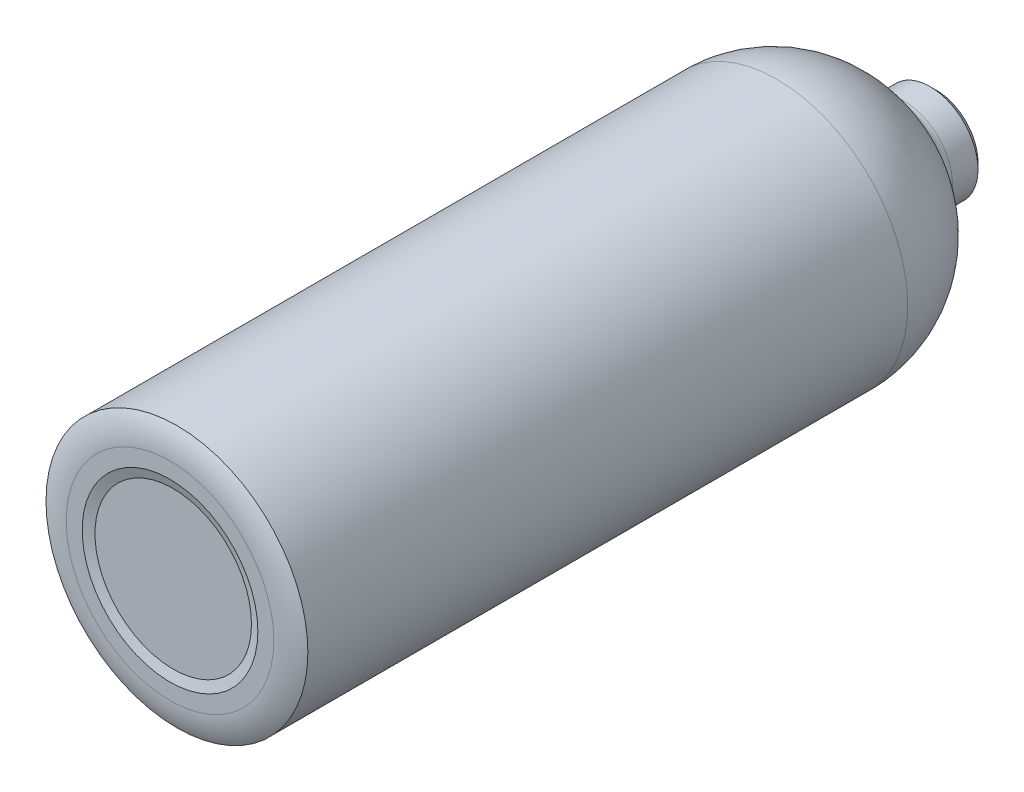
ISO-10303-21;
HEADER;
FILE_DESCRIPTION(('STEP AP214'),'2;1');
FILE_NAME('part.step','',(''),(''),'','','');
FILE_SCHEMA(('AUTOMOTIVE_DESIGN { 1 0 10303 214 1 1 1 1 }'));
ENDSEC;
DATA;
#1=APPLICATION_CONTEXT('core data for automotive mechanical design processes');
#2=APPLICATION_PROTOCOL_DEFINITION('international standard','automotive_design',2000,#1);
#3=PRODUCT_CONTEXT('',#1,'mechanical');
#4=PRODUCT('Part','Part','',(#3));
#5=PRODUCT_RELATED_PRODUCT_CATEGORY('part','',(#4));
#6=PRODUCT_DEFINITION_FORMATION('','',#4);
#7=PRODUCT_DEFINITION_CONTEXT('part definition',#1,'design');
#8=PRODUCT_DEFINITION('design','',#6,#7);
#9=PRODUCT_DEFINITION_SHAPE('','',#8);
#10=(LENGTH_UNIT() NAMED_UNIT(*) SI_UNIT(.MILLI.,.METRE.));
#11=(NAMED_UNIT(*) PLANE_ANGLE_UNIT() SI_UNIT($,.RADIAN.));
#12=(NAMED_UNIT(*) SI_UNIT($,.STERADIAN.) SOLID_ANGLE_UNIT());
#13=UNCERTAINTY_MEASURE_WITH_UNIT(LENGTH_MEASURE(1.E-05),#10,'distance_accuracy_value','');
#14=(GEOMETRIC_REPRESENTATION_CONTEXT(3) GLOBAL_UNCERTAINTY_ASSIGNED_CONTEXT((#13)) GLOBAL_UNIT_ASSIGNED_CONTEXT((#10,
#11,#12)) REPRESENTATION_CONTEXT('',''));
#15=CARTESIAN_POINT('',(0.,0.,0.));
#16=DIRECTION('',(0.,0.,1.));
#17=DIRECTION('',(1.,0.,0.));
#18=AXIS2_PLACEMENT_3D('',#15,#16,#17);
#19=CARTESIAN_POINT('',(0.,0.,52.2686182812824));
#20=DIRECTION('',(0.,0.,-1.));
#21=DIRECTION('',(-1.,0.,0.));
#22=AXIS2_PLACEMENT_3D('',#19,#20,#21);
#23=PLANE('',#22);
#24=CARTESIAN_POINT('',(0.,0.,52.2686182812824));
#25=DIRECTION('',(0.,0.,1.));
#26=DIRECTION('',(1.,0.,0.));
#27=AXIS2_PLACEMENT_3D('',#24,#25,#26);
#28=CIRCLE('',#27,24.5);
#29=CARTESIAN_POINT('',(24.5,0.,52.2686182812824));
#30=VERTEX_POINT('',#29);
#31=EDGE_CURVE('E10',#30,#30,#28,.T.);
#32=ORIENTED_EDGE('',*,*,#31,.T.);
#33=EDGE_LOOP('',(#32));
#34=FACE_BOUND('',#33,.T.);
#35=ADVANCED_FACE('F34',(#34),#23,.F.);
#36=CARTESIAN_POINT('',(0.,0.,53.2686182812824));
#37=DIRECTION('',(0.,0.,1.));
#38=DIRECTION('',(1.,0.,0.));
#39=AXIS2_PLACEMENT_3D('',#36,#37,#38);
#40=CONICAL_SURFACE('',#39,27.5,1.24904577239826);
#41=ORIENTED_EDGE('',*,*,#31,.F.);
#42=EDGE_LOOP('',(#41));
#43=FACE_BOUND('',#42,.T.);
#44=CARTESIAN_POINT('',(0.,0.,53.2686182812824));
#45=DIRECTION('',(0.,0.,1.));
#46=DIRECTION('',(1.,0.,0.));
#47=AXIS2_PLACEMENT_3D('',#44,#45,#46);
#48=CIRCLE('',#47,27.5);
#49=CARTESIAN_POINT('',(27.5,0.,53.2686182812824));
#50=VERTEX_POINT('',#49);
#51=EDGE_CURVE('E40',#50,#50,#48,.T.);
#52=ORIENTED_EDGE('',*,*,#51,.T.);
#53=EDGE_LOOP('',(#52));
#54=FACE_BOUND('',#53,.T.);
#55=ADVANCED_FACE('F96',(#43,#54),#40,.F.);
#56=CARTESIAN_POINT('',(-27.5,0.,53.2686182812824));
#57=DIRECTION('',(0.,0.,-1.));
#58=DIRECTION('',(-1.,0.,0.));
#59=AXIS2_PLACEMENT_3D('',#56,#57,#58);
#60=PLANE('',#59);
#61=ORIENTED_EDGE('',*,*,#51,.F.);
#62=EDGE_LOOP('',(#61));
#63=FACE_BOUND('',#62,.T.);
#64=CARTESIAN_POINT('',(0.,0.,53.2686182812824));
#65=DIRECTION('',(0.,0.,1.));
#66=DIRECTION('',(1.,0.,0.));
#67=AXIS2_PLACEMENT_3D('',#64,#65,#66);
#68=CIRCLE('',#67,32.5);
#69=CARTESIAN_POINT('',(32.5,0.,53.2686182812825));
#70=VERTEX_POINT('',#69);
#71=EDGE_CURVE('E44',#70,#70,#68,.T.);
#72=ORIENTED_EDGE('',*,*,#71,.T.);
#73=EDGE_LOOP('',(#72));
#74=FACE_BOUND('',#73,.T.);
#75=ADVANCED_FACE('F100',(#63,#74),#60,.F.);
#76=CARTESIAN_POINT('',(0.,0.,35.4814493175759));
#77=DIRECTION('',(0.,0.,1.));
#78=DIRECTION('',(1.,0.,0.));
#79=AXIS2_PLACEMENT_3D('',#76,#77,#78);
#80=TOROIDAL_SURFACE('',#79,32.5,17.7871689637066);
#81=ORIENTED_EDGE('',*,*,#71,.F.);
#82=EDGE_LOOP('',(#81));
#83=FACE_BOUND('',#82,.T.);
#84=CARTESIAN_POINT('',(0.,0.,51.106217467646));
#85=DIRECTION('',(0.,0.,1.));
#86=DIRECTION('',(1.,0.,0.));
#87=AXIS2_PLACEMENT_3D('',#84,#85,#86);
#88=CIRCLE('',#87,41.);
#89=CARTESIAN_POINT('',(41.,0.,51.106217467646));
#90=VERTEX_POINT('',#89);
#91=EDGE_CURVE('E48',#90,#90,#88,.T.);
#92=ORIENTED_EDGE('',*,*,#91,.T.);
#93=EDGE_LOOP('',(#92));
#94=FACE_BOUND('',#93,.T.);
#95=ADVANCED_FACE('F105',(#83,#94),#80,.T.);
#96=CARTESIAN_POINT('',(0.,0.,52.2686182812824));
#97=DIRECTION('',(0.,0.,1.));
#98=DIRECTION('',(1.,0.,0.));
#99=AXIS2_PLACEMENT_3D('',#96,#97,#98);
#100=CYLINDRICAL_SURFACE('',#99,41.0000000000001);
#101=ORIENTED_EDGE('',*,*,#91,.F.);
#102=EDGE_LOOP('',(#101));
#103=FACE_BOUND('',#102,.T.);
#104=CARTESIAN_POINT('',(1.19100314647857E-13,0.,-136.731381718718));
#105=DIRECTION('',(0.,0.,1.));
#106=DIRECTION('',(1.,0.,0.));
#107=AXIS2_PLACEMENT_3D('',#104,#105,#106);
#108=CIRCLE('',#107,41.0000000000001);
#109=CARTESIAN_POINT('',(41.0000000000002,0.,-136.731381718718));
#110=VERTEX_POINT('',#109);
#111=EDGE_CURVE('E53',#110,#110,#108,.T.);
#112=ORIENTED_EDGE('',*,*,#111,.T.);
#113=EDGE_LOOP('',(#112));
#114=FACE_BOUND('',#113,.T.);
#115=ADVANCED_FACE('F111',(#103,#114),#100,.T.);
#116=CARTESIAN_POINT('',(1.19262238973405E-13,0.,-136.731381718718));
#117=DIRECTION('',(0.,0.,1.));
#118=DIRECTION('',(1.,0.,0.));
#119=AXIS2_PLACEMENT_3D('',#116,#117,#118);
#120=DEGENERATE_TOROIDAL_SURFACE('',#119,2.70192307692321,38.2980769230769,.T.);
#121=ORIENTED_EDGE('',*,*,#111,.F.);
#122=EDGE_LOOP('',(#121));
#123=FACE_BOUND('',#122,.T.);
#124=CARTESIAN_POINT('',(1.41155928471534E-13,0.,-171.731381718718));
#125=DIRECTION('',(0.,0.,1.));
#126=DIRECTION('',(1.,0.,0.));
#127=AXIS2_PLACEMENT_3D('',#124,#125,#126);
#128=CIRCLE('',#127,18.2500000000001);
#129=CARTESIAN_POINT('',(18.2500000000003,0.,-171.731381718718));
#130=VERTEX_POINT('',#129);
#131=EDGE_CURVE('E56',#130,#130,#128,.T.);
#132=ORIENTED_EDGE('',*,*,#131,.T.);
#133=EDGE_LOOP('',(#132));
#134=FACE_BOUND('',#133,.T.);
#135=ADVANCED_FACE('F115',(#123,#134),#120,.T.);
#136=CARTESIAN_POINT('',(1.45716771982052E-13,0.,-176.731381718718));
#137=DIRECTION('',(0.,0.,1.));
#138=DIRECTION('',(1.,0.,0.));
#139=AXIS2_PLACEMENT_3D('',#136,#137,#138);
#140=TOROIDAL_SURFACE('',#139,20.471153846154,5.47115384615382);
#141=ORIENTED_EDGE('',*,*,#131,.F.);
#142=EDGE_LOOP('',(#141));
#143=FACE_BOUND('',#142,.T.);
#144=CARTESIAN_POINT('',(1.44306730446345E-13,0.,-176.731381718718));
#145=DIRECTION('',(0.,0.,1.));
#146=DIRECTION('',(1.,0.,0.));
#147=AXIS2_PLACEMENT_3D('',#144,#145,#146);
#148=CIRCLE('',#147,15.0000000000001);
#149=CARTESIAN_POINT('',(15.0000000000003,0.,-176.731381718718));
#150=VERTEX_POINT('',#149);
#151=EDGE_CURVE('E59',#150,#150,#148,.T.);
#152=ORIENTED_EDGE('',*,*,#151,.T.);
#153=EDGE_LOOP('',(#152));
#154=FACE_BOUND('',#153,.T.);
#155=ADVANCED_FACE('F119',(#143,#154),#140,.F.);
#156=CARTESIAN_POINT('',(0.,0.,52.2686182812824));
#157=DIRECTION('',(0.,0.,1.));
#158=DIRECTION('',(1.,0.,0.));
#159=AXIS2_PLACEMENT_3D('',#156,#157,#158);
#160=CYLINDRICAL_SURFACE('',#159,15.0000000000001);
#161=ORIENTED_EDGE('',*,*,#151,.F.);
#162=EDGE_LOOP('',(#161));
#163=FACE_BOUND('',#162,.T.);
#164=CARTESIAN_POINT('',(1.49348013606043E-13,0.,-184.731381718718));
#165=DIRECTION('',(0.,0.,1.));
#166=DIRECTION('',(1.,0.,0.));
#167=AXIS2_PLACEMENT_3D('',#164,#165,#166);
#168=CIRCLE('',#167,15.0000000000001);
#169=CARTESIAN_POINT('',(15.0000000000003,0.,-184.731381718718));
#170=VERTEX_POINT('',#169);
#171=EDGE_CURVE('E62',#170,#170,#168,.T.);
#172=ORIENTED_EDGE('',*,*,#171,.T.);
#173=EDGE_LOOP('',(#172));
#174=FACE_BOUND('',#173,.T.);
#175=ADVANCED_FACE('F123',(#163,#174),#160,.T.);
#176=CARTESIAN_POINT('',(1.50608334395967E-13,0.,-186.731381718718));
#177=DIRECTION('',(0.,0.,1.));
#178=DIRECTION('',(1.,0.,0.));
#179=AXIS2_PLACEMENT_3D('',#176,#177,#178);
#180=CONICAL_SURFACE('',#179,13.0000000000002,0.785398163397447);
#181=ORIENTED_EDGE('',*,*,#171,.F.);
#182=EDGE_LOOP('',(#181));
#183=FACE_BOUND('',#182,.T.);
#184=CARTESIAN_POINT('',(1.50608334395967E-13,0.,-186.731381718718));
#185=DIRECTION('',(0.,0.,1.));
#186=DIRECTION('',(1.,0.,0.));
#187=AXIS2_PLACEMENT_3D('',#184,#185,#186);
#188=CIRCLE('',#187,13.0000000000002);
#189=CARTESIAN_POINT('',(13.0000000000003,0.,-186.731381718718));
#190=VERTEX_POINT('',#189);
#191=EDGE_CURVE('E65',#190,#190,#188,.T.);
#192=ORIENTED_EDGE('',*,*,#191,.T.);
#193=EDGE_LOOP('',(#192));
#194=FACE_BOUND('',#193,.T.);
#195=ADVANCED_FACE('F127',(#183,#194),#180,.T.);
#196=CARTESIAN_POINT('',(-8.,0.,-186.731381718718));
#197=DIRECTION('',(0.,0.,1.));
#198=DIRECTION('',(1.,0.,0.));
#199=AXIS2_PLACEMENT_3D('',#196,#197,#198);
#200=PLANE('',#199);
#201=ORIENTED_EDGE('',*,*,#191,.F.);
#202=EDGE_LOOP('',(#201));
#203=FACE_BOUND('',#202,.T.);
#204=CARTESIAN_POINT('',(1.50608334395967E-13,0.,-186.731381718718));
#205=DIRECTION('',(0.,0.,1.));
#206=DIRECTION('',(1.,0.,0.));
#207=AXIS2_PLACEMENT_3D('',#204,#205,#206);
#208=CIRCLE('',#207,8.00000000000015);
#209=CARTESIAN_POINT('',(8.0000000000003,0.,-186.731381718718));
#210=VERTEX_POINT('',#209);
#211=EDGE_CURVE('E68',#210,#210,#208,.T.);
#212=ORIENTED_EDGE('',*,*,#211,.T.);
#213=EDGE_LOOP('',(#212));
#214=FACE_BOUND('',#213,.T.);
#215=ADVANCED_FACE('F131',(#203,#214),#200,.F.);
#216=CARTESIAN_POINT('',(0.,0.,52.2686182812824));
#217=DIRECTION('',(0.,0.,1.));
#218=DIRECTION('',(1.,0.,0.));
#219=AXIS2_PLACEMENT_3D('',#216,#217,#218);
#220=CYLINDRICAL_SURFACE('',#219,8.00000000000015);
#221=ORIENTED_EDGE('',*,*,#211,.F.);
#222=EDGE_LOOP('',(#221));
#223=FACE_BOUND('',#222,.T.);
#224=CARTESIAN_POINT('',(1.44306730446345E-13,0.,-176.731381718718));
#225=DIRECTION('',(0.,0.,1.));
#226=DIRECTION('',(1.,0.,0.));
#227=AXIS2_PLACEMENT_3D('',#224,#225,#226);
#228=CIRCLE('',#227,8.00000000000015);
#229=CARTESIAN_POINT('',(8.00000000000029,0.,-176.731381718718));
#230=VERTEX_POINT('',#229);
#231=EDGE_CURVE('E71',#230,#230,#228,.T.);
#232=ORIENTED_EDGE('',*,*,#231,.T.);
#233=EDGE_LOOP('',(#232));
#234=FACE_BOUND('',#233,.T.);
#235=ADVANCED_FACE('F135',(#223,#234),#220,.F.);
#236=CARTESIAN_POINT('',(1.45716771982052E-13,0.,-176.731381718718));
#237=DIRECTION('',(0.,0.,1.));
#238=DIRECTION('',(1.,0.,0.));
#239=AXIS2_PLACEMENT_3D('',#236,#237,#238);
#240=TOROIDAL_SURFACE('',#239,20.471153846154,12.4711538461538);
#241=ORIENTED_EDGE('',*,*,#231,.F.);
#242=EDGE_LOOP('',(#241));
#243=FACE_BOUND('',#242,.T.);
#244=CARTESIAN_POINT('',(1.37124673923797E-13,0.,-165.334193669508));
#245=DIRECTION('',(0.,0.,1.));
#246=DIRECTION('',(1.,0.,0.));
#247=AXIS2_PLACEMENT_3D('',#244,#245,#246);
#248=CIRCLE('',#247,15.4081722319861);
#249=CARTESIAN_POINT('',(15.4081722319862,0.,-165.334193669508));
#250=VERTEX_POINT('',#249);
#251=EDGE_CURVE('E74',#250,#250,#248,.T.);
#252=ORIENTED_EDGE('',*,*,#251,.T.);
#253=EDGE_LOOP('',(#252));
#254=FACE_BOUND('',#253,.T.);
#255=ADVANCED_FACE('F139',(#243,#254),#240,.T.);
#256=CARTESIAN_POINT('',(1.19262238973405E-13,0.,-136.731381718718));
#257=DIRECTION('',(0.,0.,1.));
#258=DIRECTION('',(1.,0.,0.));
#259=AXIS2_PLACEMENT_3D('',#256,#257,#258);
#260=DEGENERATE_TOROIDAL_SURFACE('',#259,2.70192307692321,31.2980769230769,.T.);
#261=ORIENTED_EDGE('',*,*,#251,.F.);
#262=EDGE_LOOP('',(#261));
#263=FACE_BOUND('',#262,.T.);
#264=CARTESIAN_POINT('',(1.19100314647857E-13,0.,-136.731381718718));
#265=DIRECTION('',(0.,0.,1.));
#266=DIRECTION('',(1.,0.,0.));
#267=AXIS2_PLACEMENT_3D('',#264,#265,#266);
#268=CIRCLE('',#267,34.0000000000001);
#269=CARTESIAN_POINT('',(34.0000000000002,0.,-136.731381718718));
#270=VERTEX_POINT('',#269);
#271=EDGE_CURVE('E77',#270,#270,#268,.T.);
#272=ORIENTED_EDGE('',*,*,#271,.T.);
#273=EDGE_LOOP('',(#272));
#274=FACE_BOUND('',#273,.T.);
#275=ADVANCED_FACE('F92',(#263,#274),#260,.F.);
#276=CARTESIAN_POINT('',(0.,0.,52.2686182812824));
#277=DIRECTION('',(0.,0.,1.));
#278=DIRECTION('',(1.,0.,0.));
#279=AXIS2_PLACEMENT_3D('',#276,#277,#278);
#280=CYLINDRICAL_SURFACE('',#279,34.0000000000001);
#281=ORIENTED_EDGE('',*,*,#271,.F.);
#282=EDGE_LOOP('',(#281));
#283=FACE_BOUND('',#282,.T.);
#284=CARTESIAN_POINT('',(0.,0.,46.1638186358289));
#285=DIRECTION('',(0.,0.,1.));
#286=DIRECTION('',(1.,0.,0.));
#287=AXIS2_PLACEMENT_3D('',#284,#285,#286);
#288=CIRCLE('',#287,34.);
#289=CARTESIAN_POINT('',(34.,0.,46.1638186358289));
#290=VERTEX_POINT('',#289);
#291=EDGE_CURVE('E80',#290,#290,#288,.T.);
#292=ORIENTED_EDGE('',*,*,#291,.T.);
#293=EDGE_LOOP('',(#292));
#294=FACE_BOUND('',#293,.T.);
#295=ADVANCED_FACE('F84',(#283,#294),#280,.F.);
#296=CARTESIAN_POINT('',(-34.,0.,46.1638186358289));
#297=DIRECTION('',(0.,0.,1.));
#298=DIRECTION('',(1.,0.,0.));
#299=AXIS2_PLACEMENT_3D('',#296,#297,#298);
#300=PLANE('',#299);
#301=ORIENTED_EDGE('',*,*,#291,.F.);
#302=EDGE_LOOP('',(#301));
#303=FACE_BOUND('',#302,.T.);
#304=ADVANCED_FACE('F86',(#303),#300,.F.);
#305=CLOSED_SHELL('',(#35,#55,#75,#95,#115,#135,#155,#175,#195,#215,#235,#255,#275,#295,#304));
#306=MANIFOLD_SOLID_BREP('B2',#305);
#307=ADVANCED_BREP_SHAPE_REPRESENTATION('',(#18,#306),#14);
#308=SHAPE_DEFINITION_REPRESENTATION(#9,#307);
ENDSEC;
END-ISO-10303-21;
